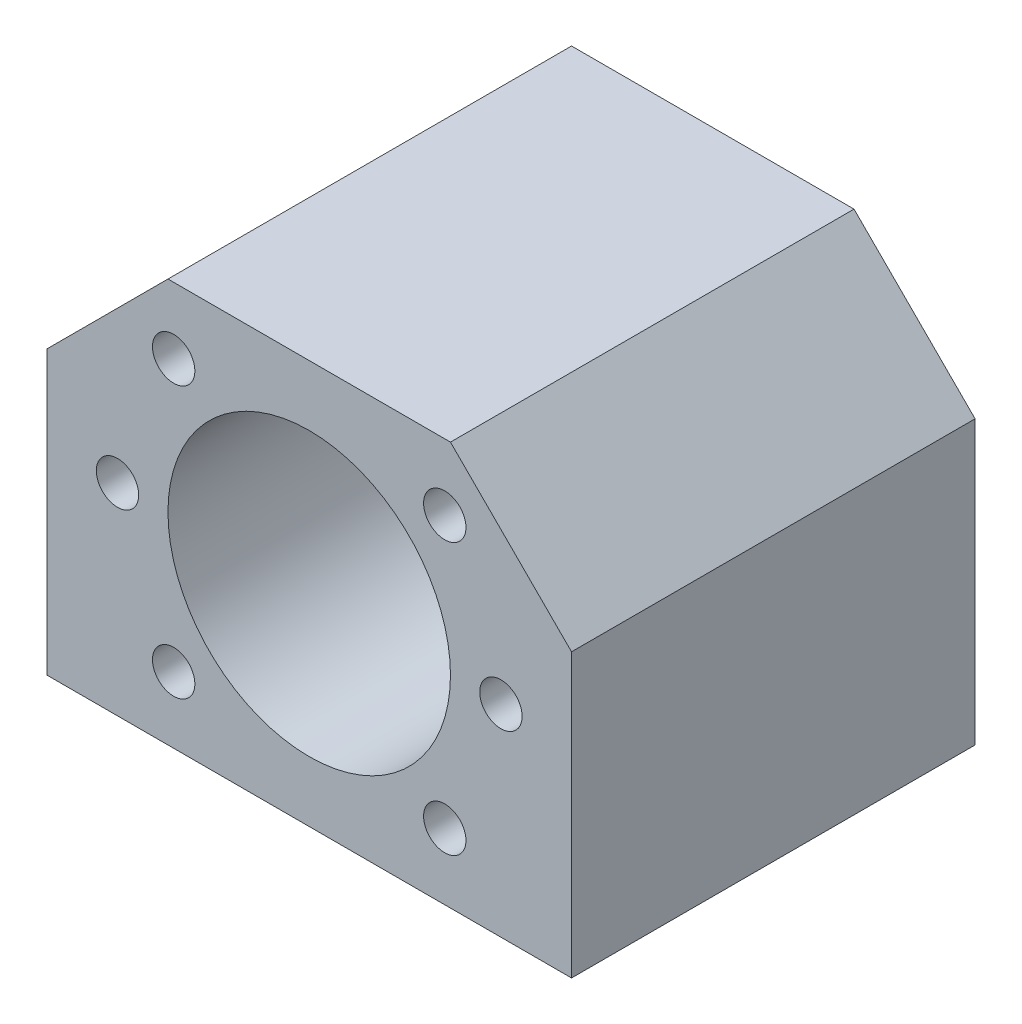
ISO-10303-21;
HEADER;
FILE_DESCRIPTION(('STEP AP214'),'2;1');
FILE_NAME('part.step','',(''),(''),'','','');
FILE_SCHEMA(('AUTOMOTIVE_DESIGN { 1 0 10303 214 1 1 1 1 }'));
ENDSEC;
DATA;
#1=APPLICATION_CONTEXT('core data for automotive mechanical design processes');
#2=APPLICATION_PROTOCOL_DEFINITION('international standard','automotive_design',2000,#1);
#3=PRODUCT_CONTEXT('',#1,'mechanical');
#4=PRODUCT('Part','Part','',(#3));
#5=PRODUCT_RELATED_PRODUCT_CATEGORY('part','',(#4));
#6=PRODUCT_DEFINITION_FORMATION('','',#4);
#7=PRODUCT_DEFINITION_CONTEXT('part definition',#1,'design');
#8=PRODUCT_DEFINITION('design','',#6,#7);
#9=PRODUCT_DEFINITION_SHAPE('','',#8);
#10=(LENGTH_UNIT() NAMED_UNIT(*) SI_UNIT(.MILLI.,.METRE.));
#11=(NAMED_UNIT(*) PLANE_ANGLE_UNIT() SI_UNIT($,.RADIAN.));
#12=(NAMED_UNIT(*) SI_UNIT($,.STERADIAN.) SOLID_ANGLE_UNIT());
#13=UNCERTAINTY_MEASURE_WITH_UNIT(LENGTH_MEASURE(1.E-05),#10,'distance_accuracy_value','');
#14=(GEOMETRIC_REPRESENTATION_CONTEXT(3) GLOBAL_UNCERTAINTY_ASSIGNED_CONTEXT((#13)) GLOBAL_UNIT_ASSIGNED_CONTEXT((#10,
#11,#12)) REPRESENTATION_CONTEXT('',''));
#15=CARTESIAN_POINT('',(0.,0.,0.));
#16=DIRECTION('',(0.,0.,1.));
#17=DIRECTION('',(1.,0.,0.));
#18=AXIS2_PLACEMENT_3D('',#15,#16,#17);
#19=CARTESIAN_POINT('',(17.,17.,20.));
#20=DIRECTION('',(0.707106781186548,0.707106781186548,0.));
#21=DIRECTION('',(-0.707106781186548,0.707106781186548,0.));
#22=AXIS2_PLACEMENT_3D('',#19,#20,#21);
#23=PLANE('',#22);
#24=DIRECTION('',(0.707106781186548,-0.707106781186548,0.));
#25=VECTOR('',#24,1.);
#26=CARTESIAN_POINT('',(17.,17.,-20.));
#27=LINE('',#26,#25);
#28=CARTESIAN_POINT('',(14.,20.,-20.));
#29=VERTEX_POINT('',#28);
#30=CARTESIAN_POINT('',(26.,8.,-20.));
#31=VERTEX_POINT('',#30);
#32=EDGE_CURVE('E128',#29,#31,#27,.T.);
#33=ORIENTED_EDGE('',*,*,#32,.F.);
#34=DIRECTION('',(0.,0.,-1.));
#35=VECTOR('',#34,1.);
#36=CARTESIAN_POINT('',(14.,20.,20.));
#37=LINE('',#36,#35);
#38=CARTESIAN_POINT('',(14.,20.,20.));
#39=VERTEX_POINT('',#38);
#40=EDGE_CURVE('E11',#39,#29,#37,.T.);
#41=ORIENTED_EDGE('',*,*,#40,.F.);
#42=DIRECTION('',(0.707106781186548,-0.707106781186548,0.));
#43=VECTOR('',#42,1.);
#44=CARTESIAN_POINT('',(17.,17.,20.));
#45=LINE('',#44,#43);
#46=CARTESIAN_POINT('',(26.,8.,20.));
#47=VERTEX_POINT('',#46);
#48=EDGE_CURVE('E156',#39,#47,#45,.T.);
#49=ORIENTED_EDGE('',*,*,#48,.T.);
#50=DIRECTION('',(0.,0.,-1.));
#51=VECTOR('',#50,1.);
#52=CARTESIAN_POINT('',(26.,8.,20.));
#53=LINE('',#52,#51);
#54=EDGE_CURVE('E86',#47,#31,#53,.T.);
#55=ORIENTED_EDGE('',*,*,#54,.T.);
#56=EDGE_LOOP('',(#33,#41,#49,#55));
#57=FACE_BOUND('',#56,.T.);
#58=ADVANCED_FACE('F40',(#57),#23,.T.);
#59=CARTESIAN_POINT('',(0.,20.,20.));
#60=DIRECTION('',(0.,-1.,0.));
#61=DIRECTION('',(1.,0.,0.));
#62=AXIS2_PLACEMENT_3D('',#59,#60,#61);
#63=PLANE('',#62);
#64=DIRECTION('',(-1.,0.,0.));
#65=VECTOR('',#64,1.);
#66=CARTESIAN_POINT('',(0.,20.,-20.));
#67=LINE('',#66,#65);
#68=CARTESIAN_POINT('',(-14.,20.,-20.));
#69=VERTEX_POINT('',#68);
#70=EDGE_CURVE('E132',#29,#69,#67,.T.);
#71=ORIENTED_EDGE('',*,*,#70,.T.);
#72=DIRECTION('',(0.,0.,-1.));
#73=VECTOR('',#72,1.);
#74=CARTESIAN_POINT('',(-14.,20.,20.));
#75=LINE('',#74,#73);
#76=CARTESIAN_POINT('',(-14.,20.,20.));
#77=VERTEX_POINT('',#76);
#78=EDGE_CURVE('E49',#77,#69,#75,.T.);
#79=ORIENTED_EDGE('',*,*,#78,.F.);
#80=DIRECTION('',(-1.,0.,0.));
#81=VECTOR('',#80,1.);
#82=CARTESIAN_POINT('',(0.,20.,20.));
#83=LINE('',#82,#81);
#84=EDGE_CURVE('E157',#39,#77,#83,.T.);
#85=ORIENTED_EDGE('',*,*,#84,.F.);
#86=ORIENTED_EDGE('',*,*,#40,.T.);
#87=EDGE_LOOP('',(#71,#79,#85,#86));
#88=FACE_BOUND('',#87,.T.);
#89=ADVANCED_FACE('F152',(#88),#63,.F.);
#90=CARTESIAN_POINT('',(-17.,17.,20.));
#91=DIRECTION('',(-0.707106781186548,0.707106781186548,0.));
#92=DIRECTION('',(-0.707106781186548,-0.707106781186548,0.));
#93=AXIS2_PLACEMENT_3D('',#90,#91,#92);
#94=PLANE('',#93);
#95=DIRECTION('',(0.707106781186548,0.707106781186548,0.));
#96=VECTOR('',#95,1.);
#97=CARTESIAN_POINT('',(-17.,17.,-20.));
#98=LINE('',#97,#96);
#99=CARTESIAN_POINT('',(-26.,8.,-20.));
#100=VERTEX_POINT('',#99);
#101=EDGE_CURVE('E135',#100,#69,#98,.T.);
#102=ORIENTED_EDGE('',*,*,#101,.F.);
#103=DIRECTION('',(0.,0.,-1.));
#104=VECTOR('',#103,1.);
#105=CARTESIAN_POINT('',(-26.,8.,20.));
#106=LINE('',#105,#104);
#107=CARTESIAN_POINT('',(-26.,8.,20.));
#108=VERTEX_POINT('',#107);
#109=EDGE_CURVE('E112',#108,#100,#106,.T.);
#110=ORIENTED_EDGE('',*,*,#109,.F.);
#111=DIRECTION('',(0.707106781186548,0.707106781186548,0.));
#112=VECTOR('',#111,1.);
#113=CARTESIAN_POINT('',(-17.,17.,20.));
#114=LINE('',#113,#112);
#115=EDGE_CURVE('E118',#108,#77,#114,.T.);
#116=ORIENTED_EDGE('',*,*,#115,.T.);
#117=ORIENTED_EDGE('',*,*,#78,.T.);
#118=EDGE_LOOP('',(#102,#110,#116,#117));
#119=FACE_BOUND('',#118,.T.);
#120=ADVANCED_FACE('F149',(#119),#94,.T.);
#121=CARTESIAN_POINT('',(-26.,0.,20.));
#122=DIRECTION('',(-1.,0.,0.));
#123=DIRECTION('',(0.,0.,1.));
#124=AXIS2_PLACEMENT_3D('',#121,#122,#123);
#125=PLANE('',#124);
#126=DIRECTION('',(0.,1.,0.));
#127=VECTOR('',#126,1.);
#128=CARTESIAN_POINT('',(-26.,0.,-20.));
#129=LINE('',#128,#127);
#130=CARTESIAN_POINT('',(-26.,-20.,-20.));
#131=VERTEX_POINT('',#130);
#132=EDGE_CURVE('E107',#131,#100,#129,.T.);
#133=ORIENTED_EDGE('',*,*,#132,.F.);
#134=DIRECTION('',(0.,0.,-1.));
#135=VECTOR('',#134,1.);
#136=CARTESIAN_POINT('',(-26.,-20.,20.));
#137=LINE('',#136,#135);
#138=CARTESIAN_POINT('',(-26.,-20.,20.));
#139=VERTEX_POINT('',#138);
#140=EDGE_CURVE('E102',#139,#131,#137,.T.);
#141=ORIENTED_EDGE('',*,*,#140,.F.);
#142=DIRECTION('',(0.,1.,0.));
#143=VECTOR('',#142,1.);
#144=CARTESIAN_POINT('',(-26.,0.,20.));
#145=LINE('',#144,#143);
#146=EDGE_CURVE('E105',#139,#108,#145,.T.);
#147=ORIENTED_EDGE('',*,*,#146,.T.);
#148=ORIENTED_EDGE('',*,*,#109,.T.);
#149=EDGE_LOOP('',(#133,#141,#147,#148));
#150=FACE_BOUND('',#149,.T.);
#151=ADVANCED_FACE('F104',(#150),#125,.T.);
#152=CARTESIAN_POINT('',(0.,-20.,20.));
#153=DIRECTION('',(0.,-1.,0.));
#154=DIRECTION('',(1.,0.,0.));
#155=AXIS2_PLACEMENT_3D('',#152,#153,#154);
#156=PLANE('',#155);
#157=CARTESIAN_POINT('',(-20.,-20.,12.));
#158=DIRECTION('',(0.,-1.,0.));
#159=DIRECTION('',(0.,0.,-1.));
#160=AXIS2_PLACEMENT_3D('',#157,#158,#159);
#161=CIRCLE('',#160,2.09999999999999);
#162=CARTESIAN_POINT('',(-20.,-20.,9.90000000000001));
#163=VERTEX_POINT('',#162);
#164=EDGE_CURVE('E219',#163,#163,#161,.T.);
#165=ORIENTED_EDGE('',*,*,#164,.F.);
#166=EDGE_LOOP('',(#165));
#167=FACE_BOUND('',#166,.T.);
#168=CARTESIAN_POINT('',(20.,-20.,12.));
#169=DIRECTION('',(0.,-1.,0.));
#170=DIRECTION('',(0.,0.,-1.));
#171=AXIS2_PLACEMENT_3D('',#168,#169,#170);
#172=CIRCLE('',#171,2.09999999999999);
#173=CARTESIAN_POINT('',(20.,-20.,9.90000000000001));
#174=VERTEX_POINT('',#173);
#175=EDGE_CURVE('E213',#174,#174,#172,.T.);
#176=ORIENTED_EDGE('',*,*,#175,.F.);
#177=EDGE_LOOP('',(#176));
#178=FACE_BOUND('',#177,.T.);
#179=CARTESIAN_POINT('',(20.,-20.,-12.));
#180=DIRECTION('',(0.,-1.,0.));
#181=DIRECTION('',(0.,0.,-1.));
#182=AXIS2_PLACEMENT_3D('',#179,#180,#181);
#183=CIRCLE('',#182,2.09999999999999);
#184=CARTESIAN_POINT('',(20.,-20.,-14.1));
#185=VERTEX_POINT('',#184);
#186=EDGE_CURVE('E207',#185,#185,#183,.T.);
#187=ORIENTED_EDGE('',*,*,#186,.F.);
#188=EDGE_LOOP('',(#187));
#189=FACE_BOUND('',#188,.T.);
#190=CARTESIAN_POINT('',(-20.,-20.,-12.));
#191=DIRECTION('',(0.,-1.,0.));
#192=DIRECTION('',(0.,0.,-1.));
#193=AXIS2_PLACEMENT_3D('',#190,#191,#192);
#194=CIRCLE('',#193,2.09999999999999);
#195=CARTESIAN_POINT('',(-20.,-20.,-14.1));
#196=VERTEX_POINT('',#195);
#197=EDGE_CURVE('E201',#196,#196,#194,.T.);
#198=ORIENTED_EDGE('',*,*,#197,.F.);
#199=EDGE_LOOP('',(#198));
#200=FACE_BOUND('',#199,.T.);
#201=DIRECTION('',(-1.,0.,0.));
#202=VECTOR('',#201,1.);
#203=CARTESIAN_POINT('',(0.,-20.,-20.));
#204=LINE('',#203,#202);
#205=CARTESIAN_POINT('',(26.,-20.,-20.));
#206=VERTEX_POINT('',#205);
#207=EDGE_CURVE('E139',#206,#131,#204,.T.);
#208=ORIENTED_EDGE('',*,*,#207,.F.);
#209=DIRECTION('',(0.,0.,-1.));
#210=VECTOR('',#209,1.);
#211=CARTESIAN_POINT('',(26.,-20.,20.));
#212=LINE('',#211,#210);
#213=CARTESIAN_POINT('',(26.,-20.,20.));
#214=VERTEX_POINT('',#213);
#215=EDGE_CURVE('E79',#214,#206,#212,.T.);
#216=ORIENTED_EDGE('',*,*,#215,.F.);
#217=DIRECTION('',(-1.,0.,0.));
#218=VECTOR('',#217,1.);
#219=CARTESIAN_POINT('',(0.,-20.,20.));
#220=LINE('',#219,#218);
#221=EDGE_CURVE('E116',#214,#139,#220,.T.);
#222=ORIENTED_EDGE('',*,*,#221,.T.);
#223=ORIENTED_EDGE('',*,*,#140,.T.);
#224=EDGE_LOOP('',(#208,#216,#222,#223));
#225=FACE_BOUND('',#224,.T.);
#226=ADVANCED_FACE('F120',(#167,#178,#189,#200,#225),#156,.T.);
#227=CARTESIAN_POINT('',(0.,0.,20.));
#228=DIRECTION('',(0.,0.,-1.));
#229=DIRECTION('',(-1.,0.,0.));
#230=AXIS2_PLACEMENT_3D('',#227,#228,#229);
#231=CYLINDRICAL_SURFACE('',#230,14.);
#232=CARTESIAN_POINT('',(0.,0.,20.));
#233=DIRECTION('',(0.,0.,1.));
#234=DIRECTION('',(1.,0.,0.));
#235=AXIS2_PLACEMENT_3D('',#232,#233,#234);
#236=CIRCLE('',#235,14.);
#237=CARTESIAN_POINT('',(14.,0.,20.));
#238=VERTEX_POINT('',#237);
#239=EDGE_CURVE('E143',#238,#238,#236,.T.);
#240=ORIENTED_EDGE('',*,*,#239,.T.);
#241=EDGE_LOOP('',(#240));
#242=FACE_BOUND('',#241,.T.);
#243=CARTESIAN_POINT('',(0.,0.,-20.));
#244=DIRECTION('',(0.,0.,1.));
#245=DIRECTION('',(1.,0.,0.));
#246=AXIS2_PLACEMENT_3D('',#243,#244,#245);
#247=CIRCLE('',#246,14.);
#248=CARTESIAN_POINT('',(14.,0.,-20.));
#249=VERTEX_POINT('',#248);
#250=EDGE_CURVE('E125',#249,#249,#247,.T.);
#251=ORIENTED_EDGE('',*,*,#250,.F.);
#252=EDGE_LOOP('',(#251));
#253=FACE_BOUND('',#252,.T.);
#254=ADVANCED_FACE('F42',(#242,#253),#231,.F.);
#255=CARTESIAN_POINT('',(26.,0.,20.));
#256=DIRECTION('',(-1.,0.,0.));
#257=DIRECTION('',(0.,0.,1.));
#258=AXIS2_PLACEMENT_3D('',#255,#256,#257);
#259=PLANE('',#258);
#260=DIRECTION('',(0.,1.,0.));
#261=VECTOR('',#260,1.);
#262=CARTESIAN_POINT('',(26.,0.,-20.));
#263=LINE('',#262,#261);
#264=EDGE_CURVE('E141',#206,#31,#263,.T.);
#265=ORIENTED_EDGE('',*,*,#264,.T.);
#266=ORIENTED_EDGE('',*,*,#54,.F.);
#267=DIRECTION('',(0.,1.,0.));
#268=VECTOR('',#267,1.);
#269=CARTESIAN_POINT('',(26.,0.,20.));
#270=LINE('',#269,#268);
#271=EDGE_CURVE('E57',#214,#47,#270,.T.);
#272=ORIENTED_EDGE('',*,*,#271,.F.);
#273=ORIENTED_EDGE('',*,*,#215,.T.);
#274=EDGE_LOOP('',(#265,#266,#272,#273));
#275=FACE_BOUND('',#274,.T.);
#276=ADVANCED_FACE('F155',(#275),#259,.F.);
#277=CARTESIAN_POINT('',(0.,0.,20.));
#278=DIRECTION('',(0.,0.,1.));
#279=DIRECTION('',(1.,0.,0.));
#280=AXIS2_PLACEMENT_3D('',#277,#278,#279);
#281=PLANE('',#280);
#282=CARTESIAN_POINT('',(19.,0.,20.));
#283=DIRECTION('',(0.,0.,1.));
#284=DIRECTION('',(1.,0.,0.));
#285=AXIS2_PLACEMENT_3D('',#282,#283,#284);
#286=CIRCLE('',#285,2.09999999999999);
#287=CARTESIAN_POINT('',(21.1,0.,20.));
#288=VERTEX_POINT('',#287);
#289=EDGE_CURVE('E195',#288,#288,#286,.T.);
#290=ORIENTED_EDGE('',*,*,#289,.F.);
#291=EDGE_LOOP('',(#290));
#292=FACE_BOUND('',#291,.T.);
#293=CARTESIAN_POINT('',(-19.,0.,20.));
#294=DIRECTION('',(0.,0.,1.));
#295=DIRECTION('',(1.,0.,0.));
#296=AXIS2_PLACEMENT_3D('',#293,#294,#295);
#297=CIRCLE('',#296,2.09999999999999);
#298=CARTESIAN_POINT('',(-16.9,0.,20.));
#299=VERTEX_POINT('',#298);
#300=EDGE_CURVE('E189',#299,#299,#297,.T.);
#301=ORIENTED_EDGE('',*,*,#300,.F.);
#302=EDGE_LOOP('',(#301));
#303=FACE_BOUND('',#302,.T.);
#304=CARTESIAN_POINT('',(-13.4350288425445,13.4350288425443,20.));
#305=DIRECTION('',(0.,0.,1.));
#306=DIRECTION('',(1.,0.,0.));
#307=AXIS2_PLACEMENT_3D('',#304,#305,#306);
#308=CIRCLE('',#307,2.09999999999999);
#309=CARTESIAN_POINT('',(-11.3350288425445,13.4350288425443,20.));
#310=VERTEX_POINT('',#309);
#311=EDGE_CURVE('E183',#310,#310,#308,.T.);
#312=ORIENTED_EDGE('',*,*,#311,.F.);
#313=EDGE_LOOP('',(#312));
#314=FACE_BOUND('',#313,.T.);
#315=CARTESIAN_POINT('',(13.4350288425445,-13.4350288425443,20.));
#316=DIRECTION('',(0.,0.,1.));
#317=DIRECTION('',(1.,0.,0.));
#318=AXIS2_PLACEMENT_3D('',#315,#316,#317);
#319=CIRCLE('',#318,2.09999999999999);
#320=CARTESIAN_POINT('',(15.5350288425445,-13.4350288425443,20.));
#321=VERTEX_POINT('',#320);
#322=EDGE_CURVE('E177',#321,#321,#319,.T.);
#323=ORIENTED_EDGE('',*,*,#322,.F.);
#324=EDGE_LOOP('',(#323));
#325=FACE_BOUND('',#324,.T.);
#326=CARTESIAN_POINT('',(13.4350288425444,13.4350288425444,20.));
#327=DIRECTION('',(0.,0.,1.));
#328=DIRECTION('',(1.,0.,0.));
#329=AXIS2_PLACEMENT_3D('',#326,#327,#328);
#330=CIRCLE('',#329,2.09999999999999);
#331=CARTESIAN_POINT('',(15.5350288425444,13.4350288425444,20.));
#332=VERTEX_POINT('',#331);
#333=EDGE_CURVE('E171',#332,#332,#330,.T.);
#334=ORIENTED_EDGE('',*,*,#333,.F.);
#335=EDGE_LOOP('',(#334));
#336=FACE_BOUND('',#335,.T.);
#337=CARTESIAN_POINT('',(-13.4350288425444,-13.4350288425444,20.));
#338=DIRECTION('',(0.,0.,1.));
#339=DIRECTION('',(1.,0.,0.));
#340=AXIS2_PLACEMENT_3D('',#337,#338,#339);
#341=CIRCLE('',#340,2.09999999999999);
#342=CARTESIAN_POINT('',(-11.3350288425444,-13.4350288425444,20.));
#343=VERTEX_POINT('',#342);
#344=EDGE_CURVE('E165',#343,#343,#341,.T.);
#345=ORIENTED_EDGE('',*,*,#344,.F.);
#346=EDGE_LOOP('',(#345));
#347=FACE_BOUND('',#346,.T.);
#348=ORIENTED_EDGE('',*,*,#239,.F.);
#349=EDGE_LOOP('',(#348));
#350=FACE_BOUND('',#349,.T.);
#351=ORIENTED_EDGE('',*,*,#48,.F.);
#352=ORIENTED_EDGE('',*,*,#84,.T.);
#353=ORIENTED_EDGE('',*,*,#115,.F.);
#354=ORIENTED_EDGE('',*,*,#146,.F.);
#355=ORIENTED_EDGE('',*,*,#221,.F.);
#356=ORIENTED_EDGE('',*,*,#271,.T.);
#357=EDGE_LOOP('',(#351,#352,#353,#354,#355,#356));
#358=FACE_BOUND('',#357,.T.);
#359=ADVANCED_FACE('F115',(#292,#303,#314,#325,#336,#347,#350,#358),#281,.T.);
#360=CARTESIAN_POINT('',(0.,0.,-20.));
#361=DIRECTION('',(0.,0.,1.));
#362=DIRECTION('',(1.,0.,0.));
#363=AXIS2_PLACEMENT_3D('',#360,#361,#362);
#364=PLANE('',#363);
#365=ORIENTED_EDGE('',*,*,#250,.T.);
#366=EDGE_LOOP('',(#365));
#367=FACE_BOUND('',#366,.T.);
#368=ORIENTED_EDGE('',*,*,#32,.T.);
#369=ORIENTED_EDGE('',*,*,#264,.F.);
#370=ORIENTED_EDGE('',*,*,#207,.T.);
#371=ORIENTED_EDGE('',*,*,#132,.T.);
#372=ORIENTED_EDGE('',*,*,#101,.T.);
#373=ORIENTED_EDGE('',*,*,#70,.F.);
#374=EDGE_LOOP('',(#368,#369,#370,#371,#372,#373));
#375=FACE_BOUND('',#374,.T.);
#376=ADVANCED_FACE('F154',(#367,#375),#364,.F.);
#377=CARTESIAN_POINT('',(-13.4350288425444,-13.4350288425444,7.80800000000001));
#378=DIRECTION('',(0.,0.,1.));
#379=DIRECTION('',(1.,0.,0.));
#380=AXIS2_PLACEMENT_3D('',#377,#378,#379);
#381=CONICAL_SURFACE('',#380,2.09999999999999,1.02974425867665);
#382=CARTESIAN_POINT('',(-13.4350288425444,-13.4350288425444,6.54619270004214));
#383=VERTEX_POINT('',#382);
#384=VERTEX_LOOP('',#383);
#385=FACE_BOUND('',#384,.T.);
#386=CARTESIAN_POINT('',(-13.4350288425444,-13.4350288425444,7.80800000000001));
#387=DIRECTION('',(0.,0.,1.));
#388=DIRECTION('',(1.,0.,0.));
#389=AXIS2_PLACEMENT_3D('',#386,#387,#388);
#390=CIRCLE('',#389,2.09999999999999);
#391=CARTESIAN_POINT('',(-11.3350288425444,-13.4350288425444,7.80800000000001));
#392=VERTEX_POINT('',#391);
#393=EDGE_CURVE('E129',#392,#392,#390,.T.);
#394=ORIENTED_EDGE('',*,*,#393,.T.);
#395=EDGE_LOOP('',(#394));
#396=FACE_BOUND('',#395,.T.);
#397=ADVANCED_FACE('F266',(#385,#396),#381,.F.);
#398=CARTESIAN_POINT('',(-13.4350288425444,-13.4350288425444,20.));
#399=DIRECTION('',(0.,0.,1.));
#400=DIRECTION('',(1.,0.,0.));
#401=AXIS2_PLACEMENT_3D('',#398,#399,#400);
#402=CYLINDRICAL_SURFACE('',#401,2.09999999999999);
#403=ORIENTED_EDGE('',*,*,#393,.F.);
#404=EDGE_LOOP('',(#403));
#405=FACE_BOUND('',#404,.T.);
#406=ORIENTED_EDGE('',*,*,#344,.T.);
#407=EDGE_LOOP('',(#406));
#408=FACE_BOUND('',#407,.T.);
#409=ADVANCED_FACE('F273',(#405,#408),#402,.F.);
#410=CARTESIAN_POINT('',(13.4350288425444,13.4350288425444,7.80800000000001));
#411=DIRECTION('',(0.,0.,1.));
#412=DIRECTION('',(1.,0.,0.));
#413=AXIS2_PLACEMENT_3D('',#410,#411,#412);
#414=CONICAL_SURFACE('',#413,2.09999999999999,1.02974425867665);
#415=CARTESIAN_POINT('',(13.4350288425444,13.4350288425444,6.54619270004214));
#416=VERTEX_POINT('',#415);
#417=VERTEX_LOOP('',#416);
#418=FACE_BOUND('',#417,.T.);
#419=CARTESIAN_POINT('',(13.4350288425444,13.4350288425444,7.80800000000001));
#420=DIRECTION('',(0.,0.,1.));
#421=DIRECTION('',(1.,0.,0.));
#422=AXIS2_PLACEMENT_3D('',#419,#420,#421);
#423=CIRCLE('',#422,2.09999999999999);
#424=CARTESIAN_POINT('',(15.5350288425444,13.4350288425444,7.80800000000001));
#425=VERTEX_POINT('',#424);
#426=EDGE_CURVE('E168',#425,#425,#423,.T.);
#427=ORIENTED_EDGE('',*,*,#426,.T.);
#428=EDGE_LOOP('',(#427));
#429=FACE_BOUND('',#428,.T.);
#430=ADVANCED_FACE('F277',(#418,#429),#414,.F.);
#431=CARTESIAN_POINT('',(13.4350288425444,13.4350288425444,20.));
#432=DIRECTION('',(0.,0.,1.));
#433=DIRECTION('',(1.,0.,0.));
#434=AXIS2_PLACEMENT_3D('',#431,#432,#433);
#435=CYLINDRICAL_SURFACE('',#434,2.09999999999999);
#436=ORIENTED_EDGE('',*,*,#426,.F.);
#437=EDGE_LOOP('',(#436));
#438=FACE_BOUND('',#437,.T.);
#439=ORIENTED_EDGE('',*,*,#333,.T.);
#440=EDGE_LOOP('',(#439));
#441=FACE_BOUND('',#440,.T.);
#442=ADVANCED_FACE('F281',(#438,#441),#435,.F.);
#443=CARTESIAN_POINT('',(13.4350288425445,-13.4350288425443,7.80800000000001));
#444=DIRECTION('',(0.,0.,1.));
#445=DIRECTION('',(1.,0.,0.));
#446=AXIS2_PLACEMENT_3D('',#443,#444,#445);
#447=CONICAL_SURFACE('',#446,2.09999999999999,1.02974425867665);
#448=CARTESIAN_POINT('',(13.4350288425445,-13.4350288425443,6.54619270004214));
#449=VERTEX_POINT('',#448);
#450=VERTEX_LOOP('',#449);
#451=FACE_BOUND('',#450,.T.);
#452=CARTESIAN_POINT('',(13.4350288425445,-13.4350288425443,7.80800000000001));
#453=DIRECTION('',(0.,0.,1.));
#454=DIRECTION('',(1.,0.,0.));
#455=AXIS2_PLACEMENT_3D('',#452,#453,#454);
#456=CIRCLE('',#455,2.09999999999999);
#457=CARTESIAN_POINT('',(15.5350288425445,-13.4350288425443,7.80800000000001));
#458=VERTEX_POINT('',#457);
#459=EDGE_CURVE('E174',#458,#458,#456,.T.);
#460=ORIENTED_EDGE('',*,*,#459,.T.);
#461=EDGE_LOOP('',(#460));
#462=FACE_BOUND('',#461,.T.);
#463=ADVANCED_FACE('F285',(#451,#462),#447,.F.);
#464=CARTESIAN_POINT('',(13.4350288425445,-13.4350288425443,20.));
#465=DIRECTION('',(0.,0.,1.));
#466=DIRECTION('',(1.,0.,0.));
#467=AXIS2_PLACEMENT_3D('',#464,#465,#466);
#468=CYLINDRICAL_SURFACE('',#467,2.09999999999999);
#469=ORIENTED_EDGE('',*,*,#459,.F.);
#470=EDGE_LOOP('',(#469));
#471=FACE_BOUND('',#470,.T.);
#472=ORIENTED_EDGE('',*,*,#322,.T.);
#473=EDGE_LOOP('',(#472));
#474=FACE_BOUND('',#473,.T.);
#475=ADVANCED_FACE('F289',(#471,#474),#468,.F.);
#476=CARTESIAN_POINT('',(-13.4350288425445,13.4350288425443,7.80800000000001));
#477=DIRECTION('',(0.,0.,1.));
#478=DIRECTION('',(1.,0.,0.));
#479=AXIS2_PLACEMENT_3D('',#476,#477,#478);
#480=CONICAL_SURFACE('',#479,2.09999999999999,1.02974425867665);
#481=CARTESIAN_POINT('',(-13.4350288425445,13.4350288425443,6.54619270004214));
#482=VERTEX_POINT('',#481);
#483=VERTEX_LOOP('',#482);
#484=FACE_BOUND('',#483,.T.);
#485=CARTESIAN_POINT('',(-13.4350288425445,13.4350288425443,7.80800000000001));
#486=DIRECTION('',(0.,0.,1.));
#487=DIRECTION('',(1.,0.,0.));
#488=AXIS2_PLACEMENT_3D('',#485,#486,#487);
#489=CIRCLE('',#488,2.09999999999999);
#490=CARTESIAN_POINT('',(-11.3350288425445,13.4350288425443,7.80800000000001));
#491=VERTEX_POINT('',#490);
#492=EDGE_CURVE('E180',#491,#491,#489,.T.);
#493=ORIENTED_EDGE('',*,*,#492,.T.);
#494=EDGE_LOOP('',(#493));
#495=FACE_BOUND('',#494,.T.);
#496=ADVANCED_FACE('F293',(#484,#495),#480,.F.);
#497=CARTESIAN_POINT('',(-13.4350288425445,13.4350288425443,20.));
#498=DIRECTION('',(0.,0.,1.));
#499=DIRECTION('',(1.,0.,0.));
#500=AXIS2_PLACEMENT_3D('',#497,#498,#499);
#501=CYLINDRICAL_SURFACE('',#500,2.09999999999999);
#502=ORIENTED_EDGE('',*,*,#492,.F.);
#503=EDGE_LOOP('',(#502));
#504=FACE_BOUND('',#503,.T.);
#505=ORIENTED_EDGE('',*,*,#311,.T.);
#506=EDGE_LOOP('',(#505));
#507=FACE_BOUND('',#506,.T.);
#508=ADVANCED_FACE('F297',(#504,#507),#501,.F.);
#509=CARTESIAN_POINT('',(-19.,0.,7.80800000000001));
#510=DIRECTION('',(0.,0.,1.));
#511=DIRECTION('',(1.,0.,0.));
#512=AXIS2_PLACEMENT_3D('',#509,#510,#511);
#513=CONICAL_SURFACE('',#512,2.09999999999999,1.02974425867665);
#514=CARTESIAN_POINT('',(-19.,0.,6.54619270004214));
#515=VERTEX_POINT('',#514);
#516=VERTEX_LOOP('',#515);
#517=FACE_BOUND('',#516,.T.);
#518=CARTESIAN_POINT('',(-19.,0.,7.80800000000001));
#519=DIRECTION('',(0.,0.,1.));
#520=DIRECTION('',(1.,0.,0.));
#521=AXIS2_PLACEMENT_3D('',#518,#519,#520);
#522=CIRCLE('',#521,2.09999999999999);
#523=CARTESIAN_POINT('',(-16.9,0.,7.80800000000001));
#524=VERTEX_POINT('',#523);
#525=EDGE_CURVE('E186',#524,#524,#522,.T.);
#526=ORIENTED_EDGE('',*,*,#525,.T.);
#527=EDGE_LOOP('',(#526));
#528=FACE_BOUND('',#527,.T.);
#529=ADVANCED_FACE('F301',(#517,#528),#513,.F.);
#530=CARTESIAN_POINT('',(-19.,0.,20.));
#531=DIRECTION('',(0.,0.,1.));
#532=DIRECTION('',(1.,0.,0.));
#533=AXIS2_PLACEMENT_3D('',#530,#531,#532);
#534=CYLINDRICAL_SURFACE('',#533,2.09999999999999);
#535=ORIENTED_EDGE('',*,*,#525,.F.);
#536=EDGE_LOOP('',(#535));
#537=FACE_BOUND('',#536,.T.);
#538=ORIENTED_EDGE('',*,*,#300,.T.);
#539=EDGE_LOOP('',(#538));
#540=FACE_BOUND('',#539,.T.);
#541=ADVANCED_FACE('F305',(#537,#540),#534,.F.);
#542=CARTESIAN_POINT('',(19.,0.,7.80800000000001));
#543=DIRECTION('',(0.,0.,1.));
#544=DIRECTION('',(1.,0.,0.));
#545=AXIS2_PLACEMENT_3D('',#542,#543,#544);
#546=CONICAL_SURFACE('',#545,2.09999999999999,1.02974425867665);
#547=CARTESIAN_POINT('',(19.,0.,6.54619270004214));
#548=VERTEX_POINT('',#547);
#549=VERTEX_LOOP('',#548);
#550=FACE_BOUND('',#549,.T.);
#551=CARTESIAN_POINT('',(19.,0.,7.80800000000001));
#552=DIRECTION('',(0.,0.,1.));
#553=DIRECTION('',(1.,0.,0.));
#554=AXIS2_PLACEMENT_3D('',#551,#552,#553);
#555=CIRCLE('',#554,2.09999999999999);
#556=CARTESIAN_POINT('',(21.1,0.,7.80800000000001));
#557=VERTEX_POINT('',#556);
#558=EDGE_CURVE('E192',#557,#557,#555,.T.);
#559=ORIENTED_EDGE('',*,*,#558,.T.);
#560=EDGE_LOOP('',(#559));
#561=FACE_BOUND('',#560,.T.);
#562=ADVANCED_FACE('F309',(#550,#561),#546,.F.);
#563=CARTESIAN_POINT('',(19.,0.,20.));
#564=DIRECTION('',(0.,0.,1.));
#565=DIRECTION('',(1.,0.,0.));
#566=AXIS2_PLACEMENT_3D('',#563,#564,#565);
#567=CYLINDRICAL_SURFACE('',#566,2.09999999999999);
#568=ORIENTED_EDGE('',*,*,#558,.F.);
#569=EDGE_LOOP('',(#568));
#570=FACE_BOUND('',#569,.T.);
#571=ORIENTED_EDGE('',*,*,#289,.T.);
#572=EDGE_LOOP('',(#571));
#573=FACE_BOUND('',#572,.T.);
#574=ADVANCED_FACE('F248',(#570,#573),#567,.F.);
#575=CARTESIAN_POINT('',(-20.,-7.80800000000001,-12.));
#576=DIRECTION('',(0.,-1.,0.));
#577=DIRECTION('',(0.,0.,-1.));
#578=AXIS2_PLACEMENT_3D('',#575,#576,#577);
#579=CONICAL_SURFACE('',#578,2.09999999999999,1.02974425867665);
#580=CARTESIAN_POINT('',(-20.,-6.54619270004212,-12.));
#581=VERTEX_POINT('',#580);
#582=VERTEX_LOOP('',#581);
#583=FACE_BOUND('',#582,.T.);
#584=CARTESIAN_POINT('',(-20.,-7.80800000000001,-12.));
#585=DIRECTION('',(0.,-1.,0.));
#586=DIRECTION('',(0.,0.,-1.));
#587=AXIS2_PLACEMENT_3D('',#584,#585,#586);
#588=CIRCLE('',#587,2.09999999999999);
#589=CARTESIAN_POINT('',(-20.,-7.80800000000001,-14.1));
#590=VERTEX_POINT('',#589);
#591=EDGE_CURVE('E198',#590,#590,#588,.T.);
#592=ORIENTED_EDGE('',*,*,#591,.T.);
#593=EDGE_LOOP('',(#592));
#594=FACE_BOUND('',#593,.T.);
#595=ADVANCED_FACE('F237',(#583,#594),#579,.F.);
#596=CARTESIAN_POINT('',(-20.,-20.,-12.));
#597=DIRECTION('',(0.,-1.,0.));
#598=DIRECTION('',(0.,0.,-1.));
#599=AXIS2_PLACEMENT_3D('',#596,#597,#598);
#600=CYLINDRICAL_SURFACE('',#599,2.09999999999999);
#601=ORIENTED_EDGE('',*,*,#591,.F.);
#602=EDGE_LOOP('',(#601));
#603=FACE_BOUND('',#602,.T.);
#604=ORIENTED_EDGE('',*,*,#197,.T.);
#605=EDGE_LOOP('',(#604));
#606=FACE_BOUND('',#605,.T.);
#607=ADVANCED_FACE('F234',(#603,#606),#600,.F.);
#608=CARTESIAN_POINT('',(20.,-7.808,-12.));
#609=DIRECTION('',(0.,-1.,0.));
#610=DIRECTION('',(0.,0.,-1.));
#611=AXIS2_PLACEMENT_3D('',#608,#609,#610);
#612=CONICAL_SURFACE('',#611,2.09999999999999,1.02974425867665);
#613=CARTESIAN_POINT('',(20.,-6.54619270004212,-12.));
#614=VERTEX_POINT('',#613);
#615=VERTEX_LOOP('',#614);
#616=FACE_BOUND('',#615,.T.);
#617=CARTESIAN_POINT('',(20.,-7.808,-12.));
#618=DIRECTION('',(0.,-1.,0.));
#619=DIRECTION('',(0.,0.,-1.));
#620=AXIS2_PLACEMENT_3D('',#617,#618,#619);
#621=CIRCLE('',#620,2.09999999999999);
#622=CARTESIAN_POINT('',(20.,-7.808,-14.1));
#623=VERTEX_POINT('',#622);
#624=EDGE_CURVE('E204',#623,#623,#621,.T.);
#625=ORIENTED_EDGE('',*,*,#624,.T.);
#626=EDGE_LOOP('',(#625));
#627=FACE_BOUND('',#626,.T.);
#628=ADVANCED_FACE('F236',(#616,#627),#612,.F.);
#629=CARTESIAN_POINT('',(20.,-20.,-12.));
#630=DIRECTION('',(0.,-1.,0.));
#631=DIRECTION('',(0.,0.,-1.));
#632=AXIS2_PLACEMENT_3D('',#629,#630,#631);
#633=CYLINDRICAL_SURFACE('',#632,2.09999999999999);
#634=ORIENTED_EDGE('',*,*,#624,.F.);
#635=EDGE_LOOP('',(#634));
#636=FACE_BOUND('',#635,.T.);
#637=ORIENTED_EDGE('',*,*,#186,.T.);
#638=EDGE_LOOP('',(#637));
#639=FACE_BOUND('',#638,.T.);
#640=ADVANCED_FACE('F244',(#636,#639),#633,.F.);
#641=CARTESIAN_POINT('',(20.,-7.808,12.));
#642=DIRECTION('',(0.,-1.,0.));
#643=DIRECTION('',(0.,0.,-1.));
#644=AXIS2_PLACEMENT_3D('',#641,#642,#643);
#645=CONICAL_SURFACE('',#644,2.09999999999999,1.02974425867665);
#646=CARTESIAN_POINT('',(20.,-6.54619270004212,12.));
#647=VERTEX_POINT('',#646);
#648=VERTEX_LOOP('',#647);
#649=FACE_BOUND('',#648,.T.);
#650=CARTESIAN_POINT('',(20.,-7.808,12.));
#651=DIRECTION('',(0.,-1.,0.));
#652=DIRECTION('',(0.,0.,-1.));
#653=AXIS2_PLACEMENT_3D('',#650,#651,#652);
#654=CIRCLE('',#653,2.09999999999999);
#655=CARTESIAN_POINT('',(20.,-7.808,9.90000000000001));
#656=VERTEX_POINT('',#655);
#657=EDGE_CURVE('E210',#656,#656,#654,.T.);
#658=ORIENTED_EDGE('',*,*,#657,.T.);
#659=EDGE_LOOP('',(#658));
#660=FACE_BOUND('',#659,.T.);
#661=ADVANCED_FACE('F452',(#649,#660),#645,.F.);
#662=CARTESIAN_POINT('',(20.,-20.,12.));
#663=DIRECTION('',(0.,-1.,0.));
#664=DIRECTION('',(0.,0.,-1.));
#665=AXIS2_PLACEMENT_3D('',#662,#663,#664);
#666=CYLINDRICAL_SURFACE('',#665,2.09999999999999);
#667=ORIENTED_EDGE('',*,*,#657,.F.);
#668=EDGE_LOOP('',(#667));
#669=FACE_BOUND('',#668,.T.);
#670=ORIENTED_EDGE('',*,*,#175,.T.);
#671=EDGE_LOOP('',(#670));
#672=FACE_BOUND('',#671,.T.);
#673=ADVANCED_FACE('F464',(#669,#672),#666,.F.);
#674=CARTESIAN_POINT('',(-20.,-7.80800000000001,12.));
#675=DIRECTION('',(0.,-1.,0.));
#676=DIRECTION('',(0.,0.,-1.));
#677=AXIS2_PLACEMENT_3D('',#674,#675,#676);
#678=CONICAL_SURFACE('',#677,2.09999999999999,1.02974425867665);
#679=CARTESIAN_POINT('',(-20.,-6.54619270004212,12.));
#680=VERTEX_POINT('',#679);
#681=VERTEX_LOOP('',#680);
#682=FACE_BOUND('',#681,.T.);
#683=CARTESIAN_POINT('',(-20.,-7.80800000000001,12.));
#684=DIRECTION('',(0.,-1.,0.));
#685=DIRECTION('',(0.,0.,-1.));
#686=AXIS2_PLACEMENT_3D('',#683,#684,#685);
#687=CIRCLE('',#686,2.09999999999999);
#688=CARTESIAN_POINT('',(-20.,-7.80800000000001,9.90000000000001));
#689=VERTEX_POINT('',#688);
#690=EDGE_CURVE('E216',#689,#689,#687,.T.);
#691=ORIENTED_EDGE('',*,*,#690,.T.);
#692=EDGE_LOOP('',(#691));
#693=FACE_BOUND('',#692,.T.);
#694=ADVANCED_FACE('F473',(#682,#693),#678,.F.);
#695=CARTESIAN_POINT('',(-20.,-20.,12.));
#696=DIRECTION('',(0.,-1.,0.));
#697=DIRECTION('',(0.,0.,-1.));
#698=AXIS2_PLACEMENT_3D('',#695,#696,#697);
#699=CYLINDRICAL_SURFACE('',#698,2.09999999999999);
#700=ORIENTED_EDGE('',*,*,#690,.F.);
#701=EDGE_LOOP('',(#700));
#702=FACE_BOUND('',#701,.T.);
#703=ORIENTED_EDGE('',*,*,#164,.T.);
#704=EDGE_LOOP('',(#703));
#705=FACE_BOUND('',#704,.T.);
#706=ADVANCED_FACE('F223',(#702,#705),#699,.F.);
#707=CLOSED_SHELL('',(#58,#89,#120,#151,#226,#254,#276,#359,#376,#397,#409,#430,#442,#463,#475,
#496,#508,#529,#541,#562,#574,#595,#607,#628,#640,#661,#673,#694,#706));
#708=MANIFOLD_SOLID_BREP('B2',#707);
#709=ADVANCED_BREP_SHAPE_REPRESENTATION('',(#18,#708),#14);
#710=SHAPE_DEFINITION_REPRESENTATION(#9,#709);
ENDSEC;
END-ISO-10303-21;
